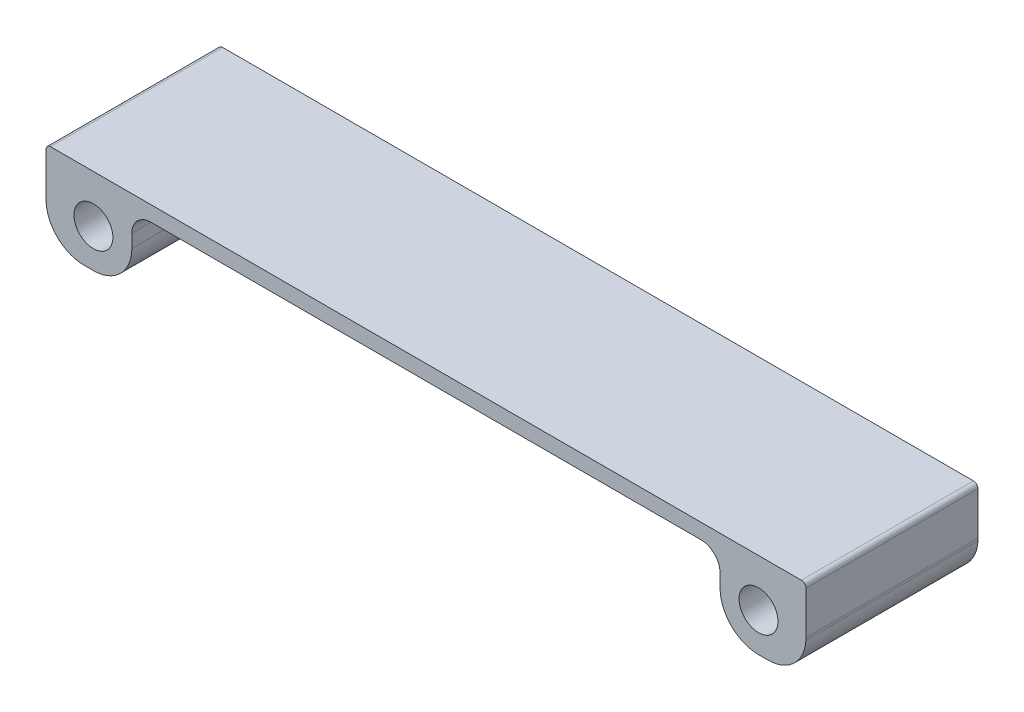
ISO-10303-21;
HEADER;
FILE_DESCRIPTION(('STEP AP214'),'2;1');
FILE_NAME('part.step','',(''),(''),'','','');
FILE_SCHEMA(('AUTOMOTIVE_DESIGN { 1 0 10303 214 1 1 1 1 }'));
ENDSEC;
DATA;
#1=APPLICATION_CONTEXT('core data for automotive mechanical design processes');
#2=APPLICATION_PROTOCOL_DEFINITION('international standard','automotive_design',2000,#1);
#3=PRODUCT_CONTEXT('',#1,'mechanical');
#4=PRODUCT('Part','Part','',(#3));
#5=PRODUCT_RELATED_PRODUCT_CATEGORY('part','',(#4));
#6=PRODUCT_DEFINITION_FORMATION('','',#4);
#7=PRODUCT_DEFINITION_CONTEXT('part definition',#1,'design');
#8=PRODUCT_DEFINITION('design','',#6,#7);
#9=PRODUCT_DEFINITION_SHAPE('','',#8);
#10=(LENGTH_UNIT() NAMED_UNIT(*) SI_UNIT(.MILLI.,.METRE.));
#11=(NAMED_UNIT(*) PLANE_ANGLE_UNIT() SI_UNIT($,.RADIAN.));
#12=(NAMED_UNIT(*) SI_UNIT($,.STERADIAN.) SOLID_ANGLE_UNIT());
#13=UNCERTAINTY_MEASURE_WITH_UNIT(LENGTH_MEASURE(1.E-05),#10,'distance_accuracy_value','');
#14=(GEOMETRIC_REPRESENTATION_CONTEXT(3) GLOBAL_UNCERTAINTY_ASSIGNED_CONTEXT((#13)) GLOBAL_UNIT_ASSIGNED_CONTEXT((#10,
#11,#12)) REPRESENTATION_CONTEXT('',''));
#15=CARTESIAN_POINT('',(0.,0.,0.));
#16=DIRECTION('',(0.,0.,1.));
#17=DIRECTION('',(1.,0.,0.));
#18=AXIS2_PLACEMENT_3D('',#15,#16,#17);
#19=CARTESIAN_POINT('',(111.1504,-6.4262,28.7528));
#20=DIRECTION('',(0.,1.,0.));
#21=DIRECTION('',(0.,0.,1.));
#22=AXIS2_PLACEMENT_3D('',#19,#20,#21);
#23=PLANE('',#22);
#24=DIRECTION('',(0.,0.,-1.));
#25=VECTOR('',#24,1.);
#26=CARTESIAN_POINT('',(112.723355371268,-6.42619999999999,28.7528));
#27=LINE('',#26,#25);
#28=CARTESIAN_POINT('',(112.723355371268,-6.4262,28.7528));
#29=VERTEX_POINT('',#28);
#30=CARTESIAN_POINT('',(112.723355371268,-6.4262,0.));
#31=VERTEX_POINT('',#30);
#32=EDGE_CURVE('E225',#29,#31,#27,.T.);
#33=ORIENTED_EDGE('',*,*,#32,.F.);
#34=DIRECTION('',(1.,0.,0.));
#35=VECTOR('',#34,1.);
#36=CARTESIAN_POINT('',(111.1504,-6.4262,28.7528));
#37=LINE('',#36,#35);
#38=CARTESIAN_POINT('',(111.1504,-6.4262,28.7528));
#39=VERTEX_POINT('',#38);
#40=EDGE_CURVE('E246',#39,#29,#37,.T.);
#41=ORIENTED_EDGE('',*,*,#40,.F.);
#42=DIRECTION('',(0.,0.,-1.));
#43=VECTOR('',#42,1.);
#44=CARTESIAN_POINT('',(111.1504,-6.42619999999999,28.7528));
#45=LINE('',#44,#43);
#46=CARTESIAN_POINT('',(111.1504,-6.4262,0.));
#47=VERTEX_POINT('',#46);
#48=EDGE_CURVE('E222',#47,#39,#45,.F.);
#49=ORIENTED_EDGE('',*,*,#48,.F.);
#50=DIRECTION('',(1.,0.,0.));
#51=VECTOR('',#50,1.);
#52=CARTESIAN_POINT('',(111.1504,-6.4262,0.));
#53=LINE('',#52,#51);
#54=EDGE_CURVE('E248',#31,#47,#53,.F.);
#55=ORIENTED_EDGE('',*,*,#54,.F.);
#56=EDGE_LOOP('',(#33,#41,#49,#55));
#57=FACE_BOUND('',#56,.T.);
#58=ADVANCED_FACE('F19',(#57),#23,.F.);
#59=CARTESIAN_POINT('',(0.,-6.4262,28.7528));
#60=DIRECTION('',(0.,1.,0.));
#61=DIRECTION('',(0.,0.,1.));
#62=AXIS2_PLACEMENT_3D('',#59,#60,#61);
#63=PLANE('',#62);
#64=DIRECTION('',(0.,0.,-1.));
#65=VECTOR('',#64,1.);
#66=CARTESIAN_POINT('',(-1.57295537126772,-6.4262,28.7528));
#67=LINE('',#66,#65);
#68=CARTESIAN_POINT('',(-1.57295537126772,-6.4262,0.));
#69=VERTEX_POINT('',#68);
#70=CARTESIAN_POINT('',(-1.57295537126772,-6.4262,28.7528));
#71=VERTEX_POINT('',#70);
#72=EDGE_CURVE('E155',#69,#71,#67,.F.);
#73=ORIENTED_EDGE('',*,*,#72,.F.);
#74=DIRECTION('',(1.,0.,0.));
#75=VECTOR('',#74,1.);
#76=CARTESIAN_POINT('',(0.,-6.4262,0.));
#77=LINE('',#76,#75);
#78=CARTESIAN_POINT('',(0.,-6.4262,0.));
#79=VERTEX_POINT('',#78);
#80=EDGE_CURVE('E161',#79,#69,#77,.F.);
#81=ORIENTED_EDGE('',*,*,#80,.F.);
#82=DIRECTION('',(0.,0.,-1.));
#83=VECTOR('',#82,1.);
#84=CARTESIAN_POINT('',(0.,-6.4262,28.7528));
#85=LINE('',#84,#83);
#86=CARTESIAN_POINT('',(0.,-6.4262,28.7528));
#87=VERTEX_POINT('',#86);
#88=EDGE_CURVE('E156',#87,#79,#85,.T.);
#89=ORIENTED_EDGE('',*,*,#88,.F.);
#90=DIRECTION('',(1.,0.,0.));
#91=VECTOR('',#90,1.);
#92=CARTESIAN_POINT('',(0.,-6.4262,28.7528));
#93=LINE('',#92,#91);
#94=EDGE_CURVE('E147',#71,#87,#93,.T.);
#95=ORIENTED_EDGE('',*,*,#94,.F.);
#96=EDGE_LOOP('',(#73,#81,#89,#95));
#97=FACE_BOUND('',#96,.T.);
#98=ADVANCED_FACE('F260',(#97),#63,.F.);
#99=CARTESIAN_POINT('',(0.,0.,28.7528));
#100=DIRECTION('',(0.,0.,-1.));
#101=DIRECTION('',(-1.,0.,0.));
#102=AXIS2_PLACEMENT_3D('',#99,#100,#101);
#103=CYLINDRICAL_SURFACE('',#102,7.92479999999999);
#104=CARTESIAN_POINT('',(0.,0.,28.7528));
#105=DIRECTION('',(0.,0.,-1.));
#106=DIRECTION('',(-1.,0.,0.));
#107=AXIS2_PLACEMENT_3D('',#104,#105,#106);
#108=CIRCLE('',#107,7.92479999999999);
#109=CARTESIAN_POINT('',(-7.91551735218598,-0.38345806451614,28.7528));
#110=VERTEX_POINT('',#109);
#111=CARTESIAN_POINT('',(-7.9248,0.,28.7528));
#112=VERTEX_POINT('',#111);
#113=EDGE_CURVE('E146',#110,#112,#108,.T.);
#114=ORIENTED_EDGE('',*,*,#113,.T.);
#115=DIRECTION('',(0.,0.,1.));
#116=VECTOR('',#115,1.);
#117=CARTESIAN_POINT('',(-7.9248,0.,28.7528));
#118=LINE('',#117,#116);
#119=CARTESIAN_POINT('',(-7.9248,0.,0.));
#120=VERTEX_POINT('',#119);
#121=EDGE_CURVE('E144',#112,#120,#118,.F.);
#122=ORIENTED_EDGE('',*,*,#121,.T.);
#123=CARTESIAN_POINT('',(0.,0.,0.));
#124=DIRECTION('',(0.,0.,-1.));
#125=DIRECTION('',(-1.,0.,0.));
#126=AXIS2_PLACEMENT_3D('',#123,#124,#125);
#127=CIRCLE('',#126,7.92479999999999);
#128=CARTESIAN_POINT('',(-7.91551735218598,-0.38345806451614,0.));
#129=VERTEX_POINT('',#128);
#130=EDGE_CURVE('E22',#120,#129,#127,.F.);
#131=ORIENTED_EDGE('',*,*,#130,.T.);
#132=DIRECTION('',(0.,0.,-1.));
#133=VECTOR('',#132,1.);
#134=CARTESIAN_POINT('',(-7.91551735218598,-0.383458064516141,28.7528));
#135=LINE('',#134,#133);
#136=EDGE_CURVE('E141',#110,#129,#135,.T.);
#137=ORIENTED_EDGE('',*,*,#136,.F.);
#138=EDGE_LOOP('',(#114,#122,#131,#137));
#139=FACE_BOUND('',#138,.T.);
#140=ADVANCED_FACE('F140',(#139),#103,.T.);
#141=CARTESIAN_POINT('',(111.1504,0.,28.7528));
#142=DIRECTION('',(0.,0.,-1.));
#143=DIRECTION('',(-1.,0.,0.));
#144=AXIS2_PLACEMENT_3D('',#141,#142,#143);
#145=CYLINDRICAL_SURFACE('',#144,7.9248);
#146=CARTESIAN_POINT('',(111.1504,0.,0.));
#147=DIRECTION('',(0.,0.,-1.));
#148=DIRECTION('',(-1.,0.,0.));
#149=AXIS2_PLACEMENT_3D('',#146,#147,#148);
#150=CIRCLE('',#149,7.9248);
#151=CARTESIAN_POINT('',(119.065917352186,-0.383458064516131,0.));
#152=VERTEX_POINT('',#151);
#153=CARTESIAN_POINT('',(119.0752,0.,0.));
#154=VERTEX_POINT('',#153);
#155=EDGE_CURVE('E560',#152,#154,#150,.F.);
#156=ORIENTED_EDGE('',*,*,#155,.T.);
#157=DIRECTION('',(0.,0.,1.));
#158=VECTOR('',#157,1.);
#159=CARTESIAN_POINT('',(119.0752,0.,28.7528));
#160=LINE('',#159,#158);
#161=CARTESIAN_POINT('',(119.0752,0.,28.7528));
#162=VERTEX_POINT('',#161);
#163=EDGE_CURVE('E313',#154,#162,#160,.T.);
#164=ORIENTED_EDGE('',*,*,#163,.T.);
#165=CARTESIAN_POINT('',(111.1504,0.,28.7528));
#166=DIRECTION('',(0.,0.,-1.));
#167=DIRECTION('',(-1.,0.,0.));
#168=AXIS2_PLACEMENT_3D('',#165,#166,#167);
#169=CIRCLE('',#168,7.9248);
#170=CARTESIAN_POINT('',(119.065917352186,-0.383458064516131,28.7528));
#171=VERTEX_POINT('',#170);
#172=EDGE_CURVE('E559',#162,#171,#169,.T.);
#173=ORIENTED_EDGE('',*,*,#172,.T.);
#174=DIRECTION('',(0.,0.,-1.));
#175=VECTOR('',#174,1.);
#176=CARTESIAN_POINT('',(119.065917352186,-0.38345806451613,28.7528));
#177=LINE('',#176,#175);
#178=EDGE_CURVE('E229',#152,#171,#177,.F.);
#179=ORIENTED_EDGE('',*,*,#178,.F.);
#180=EDGE_LOOP('',(#156,#164,#173,#179));
#181=FACE_BOUND('',#180,.T.);
#182=ADVANCED_FACE('F508',(#181),#145,.T.);
#183=CARTESIAN_POINT('',(112.723355371268,-0.0762000000000002,28.7528));
#184=DIRECTION('',(0.,0.,-1.));
#185=DIRECTION('',(-1.,0.,0.));
#186=AXIS2_PLACEMENT_3D('',#183,#184,#185);
#187=CYLINDRICAL_SURFACE('',#186,6.34999999999999);
#188=CARTESIAN_POINT('',(112.723355371268,-0.0762000000000002,28.7528));
#189=DIRECTION('',(0.,0.,-1.));
#190=DIRECTION('',(-1.,0.,0.));
#191=AXIS2_PLACEMENT_3D('',#188,#189,#190);
#192=CIRCLE('',#191,6.34999999999999);
#193=EDGE_CURVE('E185',#171,#29,#192,.T.);
#194=ORIENTED_EDGE('',*,*,#193,.T.);
#195=ORIENTED_EDGE('',*,*,#32,.T.);
#196=CARTESIAN_POINT('',(112.723355371268,-0.0762000000000002,0.));
#197=DIRECTION('',(0.,0.,-1.));
#198=DIRECTION('',(-1.,0.,0.));
#199=AXIS2_PLACEMENT_3D('',#196,#197,#198);
#200=CIRCLE('',#199,6.34999999999999);
#201=EDGE_CURVE('E325',#152,#31,#200,.T.);
#202=ORIENTED_EDGE('',*,*,#201,.F.);
#203=ORIENTED_EDGE('',*,*,#178,.T.);
#204=EDGE_LOOP('',(#194,#195,#202,#203));
#205=FACE_BOUND('',#204,.T.);
#206=ADVANCED_FACE('F500',(#205),#187,.T.);
#207=CARTESIAN_POINT('',(111.1504,0.,28.7528));
#208=DIRECTION('',(0.,0.,-1.));
#209=DIRECTION('',(-1.,0.,0.));
#210=AXIS2_PLACEMENT_3D('',#207,#208,#209);
#211=CYLINDRICAL_SURFACE('',#210,6.42619999999999);
#212=CARTESIAN_POINT('',(111.1504,0.,28.7528));
#213=DIRECTION('',(0.,0.,-1.));
#214=DIRECTION('',(-1.,0.,0.));
#215=AXIS2_PLACEMENT_3D('',#212,#213,#214);
#216=CIRCLE('',#215,6.42619999999999);
#217=CARTESIAN_POINT('',(104.7242,0.,28.7528));
#218=VERTEX_POINT('',#217);
#219=EDGE_CURVE('E201',#39,#218,#216,.T.);
#220=ORIENTED_EDGE('',*,*,#219,.T.);
#221=DIRECTION('',(0.,0.,1.));
#222=VECTOR('',#221,1.);
#223=CARTESIAN_POINT('',(104.7242,0.,28.7528));
#224=LINE('',#223,#222);
#225=CARTESIAN_POINT('',(104.7242,0.,0.));
#226=VERTEX_POINT('',#225);
#227=EDGE_CURVE('E219',#218,#226,#224,.F.);
#228=ORIENTED_EDGE('',*,*,#227,.T.);
#229=CARTESIAN_POINT('',(111.1504,0.,0.));
#230=DIRECTION('',(0.,0.,-1.));
#231=DIRECTION('',(-1.,0.,0.));
#232=AXIS2_PLACEMENT_3D('',#229,#230,#231);
#233=CIRCLE('',#232,6.42619999999999);
#234=EDGE_CURVE('E296',#47,#226,#233,.T.);
#235=ORIENTED_EDGE('',*,*,#234,.F.);
#236=ORIENTED_EDGE('',*,*,#48,.T.);
#237=EDGE_LOOP('',(#220,#228,#235,#236));
#238=FACE_BOUND('',#237,.T.);
#239=ADVANCED_FACE('F338',(#238),#211,.T.);
#240=CARTESIAN_POINT('',(104.7242,0.,28.7528));
#241=DIRECTION('',(1.,0.,0.));
#242=DIRECTION('',(0.,1.,0.));
#243=AXIS2_PLACEMENT_3D('',#240,#241,#242);
#244=PLANE('',#243);
#245=ORIENTED_EDGE('',*,*,#227,.F.);
#246=DIRECTION('',(0.,1.,0.));
#247=VECTOR('',#246,1.);
#248=CARTESIAN_POINT('',(104.7242,-5.6642,28.7528));
#249=LINE('',#248,#247);
#250=CARTESIAN_POINT('',(104.7242,2.2098,28.7528));
#251=VERTEX_POINT('',#250);
#252=EDGE_CURVE('E200',#218,#251,#249,.T.);
#253=ORIENTED_EDGE('',*,*,#252,.T.);
#254=DIRECTION('',(0.,0.,-1.));
#255=VECTOR('',#254,1.);
#256=CARTESIAN_POINT('',(104.7242,2.2098,28.7528));
#257=LINE('',#256,#255);
#258=CARTESIAN_POINT('',(104.7242,2.2098,0.));
#259=VERTEX_POINT('',#258);
#260=EDGE_CURVE('E213',#251,#259,#257,.T.);
#261=ORIENTED_EDGE('',*,*,#260,.T.);
#262=DIRECTION('',(0.,1.,0.));
#263=VECTOR('',#262,1.);
#264=CARTESIAN_POINT('',(104.7242,-5.6642,0.));
#265=LINE('',#264,#263);
#266=EDGE_CURVE('E292',#226,#259,#265,.T.);
#267=ORIENTED_EDGE('',*,*,#266,.F.);
#268=EDGE_LOOP('',(#245,#253,#261,#267));
#269=FACE_BOUND('',#268,.T.);
#270=ADVANCED_FACE('F342',(#269),#244,.F.);
#271=CARTESIAN_POINT('',(101.5492,2.2098,28.7528));
#272=DIRECTION('',(0.,0.,-1.));
#273=DIRECTION('',(-1.,0.,0.));
#274=AXIS2_PLACEMENT_3D('',#271,#272,#273);
#275=CYLINDRICAL_SURFACE('',#274,3.17500000000001);
#276=ORIENTED_EDGE('',*,*,#260,.F.);
#277=CARTESIAN_POINT('',(101.5492,2.2098,28.7528));
#278=DIRECTION('',(0.,0.,-1.));
#279=DIRECTION('',(-1.,0.,0.));
#280=AXIS2_PLACEMENT_3D('',#277,#278,#279);
#281=CIRCLE('',#280,3.17500000000001);
#282=CARTESIAN_POINT('',(101.5492,5.3848,28.7528));
#283=VERTEX_POINT('',#282);
#284=EDGE_CURVE('E197',#251,#283,#281,.F.);
#285=ORIENTED_EDGE('',*,*,#284,.T.);
#286=DIRECTION('',(0.,0.,1.));
#287=VECTOR('',#286,1.);
#288=CARTESIAN_POINT('',(101.5492,5.3848,28.7528));
#289=LINE('',#288,#287);
#290=CARTESIAN_POINT('',(101.5492,5.3848,0.));
#291=VERTEX_POINT('',#290);
#292=EDGE_CURVE('E218',#283,#291,#289,.F.);
#293=ORIENTED_EDGE('',*,*,#292,.T.);
#294=CARTESIAN_POINT('',(101.5492,2.2098,0.));
#295=DIRECTION('',(0.,0.,-1.));
#296=DIRECTION('',(-1.,0.,0.));
#297=AXIS2_PLACEMENT_3D('',#294,#295,#296);
#298=CIRCLE('',#297,3.17500000000001);
#299=EDGE_CURVE('E285',#259,#291,#298,.F.);
#300=ORIENTED_EDGE('',*,*,#299,.F.);
#301=EDGE_LOOP('',(#276,#285,#293,#300));
#302=FACE_BOUND('',#301,.T.);
#303=ADVANCED_FACE('F284',(#302),#275,.F.);
#304=CARTESIAN_POINT('',(101.5492,5.3848,28.7528));
#305=DIRECTION('',(0.,1.,0.));
#306=DIRECTION('',(-1.,0.,0.));
#307=AXIS2_PLACEMENT_3D('',#304,#305,#306);
#308=PLANE('',#307);
#309=ORIENTED_EDGE('',*,*,#292,.F.);
#310=DIRECTION('',(-1.,0.,0.));
#311=VECTOR('',#310,1.);
#312=CARTESIAN_POINT('',(-7.1628,5.3848,28.7528));
#313=LINE('',#312,#311);
#314=CARTESIAN_POINT('',(9.6012,5.38479999999999,28.7528));
#315=VERTEX_POINT('',#314);
#316=EDGE_CURVE('E196',#283,#315,#313,.T.);
#317=ORIENTED_EDGE('',*,*,#316,.T.);
#318=DIRECTION('',(0.,0.,-1.));
#319=VECTOR('',#318,1.);
#320=CARTESIAN_POINT('',(9.6012,5.38479999999999,28.7528));
#321=LINE('',#320,#319);
#322=CARTESIAN_POINT('',(9.6012,5.38479999999999,0.));
#323=VERTEX_POINT('',#322);
#324=EDGE_CURVE('E272',#315,#323,#321,.T.);
#325=ORIENTED_EDGE('',*,*,#324,.T.);
#326=DIRECTION('',(-1.,0.,0.));
#327=VECTOR('',#326,1.);
#328=CARTESIAN_POINT('',(-7.1628,5.3848,0.));
#329=LINE('',#328,#327);
#330=EDGE_CURVE('E288',#291,#323,#329,.T.);
#331=ORIENTED_EDGE('',*,*,#330,.F.);
#332=EDGE_LOOP('',(#309,#317,#325,#331));
#333=FACE_BOUND('',#332,.T.);
#334=ADVANCED_FACE('F289',(#333),#308,.F.);
#335=CARTESIAN_POINT('',(9.6012,2.20979999999999,28.7528));
#336=DIRECTION('',(0.,0.,-1.));
#337=DIRECTION('',(-1.,0.,0.));
#338=AXIS2_PLACEMENT_3D('',#335,#336,#337);
#339=CYLINDRICAL_SURFACE('',#338,3.175);
#340=ORIENTED_EDGE('',*,*,#324,.F.);
#341=CARTESIAN_POINT('',(9.6012,2.20979999999999,28.7528));
#342=DIRECTION('',(0.,0.,-1.));
#343=DIRECTION('',(-1.,0.,0.));
#344=AXIS2_PLACEMENT_3D('',#341,#342,#343);
#345=CIRCLE('',#344,3.175);
#346=CARTESIAN_POINT('',(6.4262,2.20979999999999,28.7528));
#347=VERTEX_POINT('',#346);
#348=EDGE_CURVE('E193',#315,#347,#345,.F.);
#349=ORIENTED_EDGE('',*,*,#348,.T.);
#350=DIRECTION('',(0.,0.,1.));
#351=VECTOR('',#350,1.);
#352=CARTESIAN_POINT('',(6.4262,2.20979999999999,28.7528));
#353=LINE('',#352,#351);
#354=CARTESIAN_POINT('',(6.4262,2.20979999999999,0.));
#355=VERTEX_POINT('',#354);
#356=EDGE_CURVE('E269',#347,#355,#353,.F.);
#357=ORIENTED_EDGE('',*,*,#356,.T.);
#358=CARTESIAN_POINT('',(9.6012,2.20979999999999,0.));
#359=DIRECTION('',(0.,0.,-1.));
#360=DIRECTION('',(-1.,0.,0.));
#361=AXIS2_PLACEMENT_3D('',#358,#359,#360);
#362=CIRCLE('',#361,3.175);
#363=EDGE_CURVE('E290',#323,#355,#362,.F.);
#364=ORIENTED_EDGE('',*,*,#363,.F.);
#365=EDGE_LOOP('',(#340,#349,#357,#364));
#366=FACE_BOUND('',#365,.T.);
#367=ADVANCED_FACE('F345',(#366),#339,.F.);
#368=CARTESIAN_POINT('',(6.4262,0.,28.7528));
#369=DIRECTION('',(-1.,0.,0.));
#370=DIRECTION('',(0.,0.,1.));
#371=AXIS2_PLACEMENT_3D('',#368,#369,#370);
#372=PLANE('',#371);
#373=ORIENTED_EDGE('',*,*,#356,.F.);
#374=DIRECTION('',(0.,1.,0.));
#375=VECTOR('',#374,1.);
#376=CARTESIAN_POINT('',(6.4262,-5.6642,28.7528));
#377=LINE('',#376,#375);
#378=CARTESIAN_POINT('',(6.4262,0.,28.7528));
#379=VERTEX_POINT('',#378);
#380=EDGE_CURVE('E192',#347,#379,#377,.F.);
#381=ORIENTED_EDGE('',*,*,#380,.T.);
#382=DIRECTION('',(0.,0.,-1.));
#383=VECTOR('',#382,1.);
#384=CARTESIAN_POINT('',(6.4262,0.,28.7528));
#385=LINE('',#384,#383);
#386=CARTESIAN_POINT('',(6.4262,0.,0.));
#387=VERTEX_POINT('',#386);
#388=EDGE_CURVE('E263',#387,#379,#385,.F.);
#389=ORIENTED_EDGE('',*,*,#388,.F.);
#390=DIRECTION('',(0.,1.,0.));
#391=VECTOR('',#390,1.);
#392=CARTESIAN_POINT('',(6.4262,-5.6642,0.));
#393=LINE('',#392,#391);
#394=EDGE_CURVE('E167',#355,#387,#393,.F.);
#395=ORIENTED_EDGE('',*,*,#394,.F.);
#396=EDGE_LOOP('',(#373,#381,#389,#395));
#397=FACE_BOUND('',#396,.T.);
#398=ADVANCED_FACE('F346',(#397),#372,.F.);
#399=CARTESIAN_POINT('',(0.,0.,28.7528));
#400=DIRECTION('',(0.,0.,-1.));
#401=DIRECTION('',(-1.,0.,0.));
#402=AXIS2_PLACEMENT_3D('',#399,#400,#401);
#403=CYLINDRICAL_SURFACE('',#402,6.4262);
#404=CARTESIAN_POINT('',(0.,0.,28.7528));
#405=DIRECTION('',(0.,0.,-1.));
#406=DIRECTION('',(-1.,0.,0.));
#407=AXIS2_PLACEMENT_3D('',#404,#405,#406);
#408=CIRCLE('',#407,6.4262);
#409=EDGE_CURVE('E188',#379,#87,#408,.T.);
#410=ORIENTED_EDGE('',*,*,#409,.T.);
#411=ORIENTED_EDGE('',*,*,#88,.T.);
#412=CARTESIAN_POINT('',(0.,0.,0.));
#413=DIRECTION('',(0.,0.,-1.));
#414=DIRECTION('',(-1.,0.,0.));
#415=AXIS2_PLACEMENT_3D('',#412,#413,#414);
#416=CIRCLE('',#415,6.4262);
#417=EDGE_CURVE('E164',#387,#79,#416,.T.);
#418=ORIENTED_EDGE('',*,*,#417,.F.);
#419=ORIENTED_EDGE('',*,*,#388,.T.);
#420=EDGE_LOOP('',(#410,#411,#418,#419));
#421=FACE_BOUND('',#420,.T.);
#422=ADVANCED_FACE('F265',(#421),#403,.T.);
#423=CARTESIAN_POINT('',(-1.57295537126772,-0.0762000000000002,28.7528));
#424=DIRECTION('',(0.,0.,-1.));
#425=DIRECTION('',(-1.,0.,0.));
#426=AXIS2_PLACEMENT_3D('',#423,#424,#425);
#427=CYLINDRICAL_SURFACE('',#426,6.35);
#428=CARTESIAN_POINT('',(-1.57295537126772,-0.0762000000000002,0.));
#429=DIRECTION('',(0.,0.,-1.));
#430=DIRECTION('',(-1.,0.,0.));
#431=AXIS2_PLACEMENT_3D('',#428,#429,#430);
#432=CIRCLE('',#431,6.35);
#433=EDGE_CURVE('E152',#69,#129,#432,.T.);
#434=ORIENTED_EDGE('',*,*,#433,.F.);
#435=ORIENTED_EDGE('',*,*,#72,.T.);
#436=CARTESIAN_POINT('',(-1.57295537126772,-0.0762000000000002,28.7528));
#437=DIRECTION('',(0.,0.,-1.));
#438=DIRECTION('',(-1.,0.,0.));
#439=AXIS2_PLACEMENT_3D('',#436,#437,#438);
#440=CIRCLE('',#439,6.35);
#441=EDGE_CURVE('E154',#71,#110,#440,.T.);
#442=ORIENTED_EDGE('',*,*,#441,.T.);
#443=ORIENTED_EDGE('',*,*,#136,.T.);
#444=EDGE_LOOP('',(#434,#435,#442,#443));
#445=FACE_BOUND('',#444,.T.);
#446=ADVANCED_FACE('F150',(#445),#427,.T.);
#447=CARTESIAN_POINT('',(-7.9248,7.16279999999999,28.7528));
#448=DIRECTION('',(1.,0.,0.));
#449=DIRECTION('',(0.,1.,0.));
#450=AXIS2_PLACEMENT_3D('',#447,#448,#449);
#451=PLANE('',#450);
#452=ORIENTED_EDGE('',*,*,#121,.F.);
#453=DIRECTION('',(0.,1.,0.));
#454=VECTOR('',#453,1.);
#455=CARTESIAN_POINT('',(-7.9248,-5.6642,28.7528));
#456=LINE('',#455,#454);
#457=CARTESIAN_POINT('',(-7.9248,7.1628,28.7528));
#458=VERTEX_POINT('',#457);
#459=EDGE_CURVE('E184',#112,#458,#456,.T.);
#460=ORIENTED_EDGE('',*,*,#459,.T.);
#461=DIRECTION('',(0.,0.,-1.));
#462=VECTOR('',#461,1.);
#463=CARTESIAN_POINT('',(-7.9248,7.1628,28.7528));
#464=LINE('',#463,#462);
#465=CARTESIAN_POINT('',(-7.9248,7.1628,0.));
#466=VERTEX_POINT('',#465);
#467=EDGE_CURVE('E319',#466,#458,#464,.F.);
#468=ORIENTED_EDGE('',*,*,#467,.F.);
#469=DIRECTION('',(0.,1.,0.));
#470=VECTOR('',#469,1.);
#471=CARTESIAN_POINT('',(-7.9248,-5.6642,0.));
#472=LINE('',#471,#470);
#473=EDGE_CURVE('E163',#120,#466,#472,.T.);
#474=ORIENTED_EDGE('',*,*,#473,.F.);
#475=EDGE_LOOP('',(#452,#460,#468,#474));
#476=FACE_BOUND('',#475,.T.);
#477=ADVANCED_FACE('F387',(#476),#451,.F.);
#478=CARTESIAN_POINT('',(119.0752,7.16279999999999,28.7528));
#479=DIRECTION('',(-1.,0.,0.));
#480=DIRECTION('',(0.,0.,1.));
#481=AXIS2_PLACEMENT_3D('',#478,#479,#480);
#482=PLANE('',#481);
#483=DIRECTION('',(0.,1.,0.));
#484=VECTOR('',#483,1.);
#485=CARTESIAN_POINT('',(119.0752,-5.6642,0.));
#486=LINE('',#485,#484);
#487=CARTESIAN_POINT('',(119.0752,7.1628,0.));
#488=VERTEX_POINT('',#487);
#489=EDGE_CURVE('E238',#488,#154,#486,.F.);
#490=ORIENTED_EDGE('',*,*,#489,.F.);
#491=DIRECTION('',(0.,0.,-1.));
#492=VECTOR('',#491,1.);
#493=CARTESIAN_POINT('',(119.0752,7.16279999999999,28.7528));
#494=LINE('',#493,#492);
#495=CARTESIAN_POINT('',(119.0752,7.1628,28.7528));
#496=VERTEX_POINT('',#495);
#497=EDGE_CURVE('E316',#496,#488,#494,.T.);
#498=ORIENTED_EDGE('',*,*,#497,.F.);
#499=DIRECTION('',(0.,1.,0.));
#500=VECTOR('',#499,1.);
#501=CARTESIAN_POINT('',(119.0752,-5.6642,28.7528));
#502=LINE('',#501,#500);
#503=EDGE_CURVE('E183',#496,#162,#502,.F.);
#504=ORIENTED_EDGE('',*,*,#503,.T.);
#505=ORIENTED_EDGE('',*,*,#163,.F.);
#506=EDGE_LOOP('',(#490,#498,#504,#505));
#507=FACE_BOUND('',#506,.T.);
#508=ADVANCED_FACE('F383',(#507),#482,.F.);
#509=CARTESIAN_POINT('',(0.,0.,28.7528));
#510=DIRECTION('',(0.,0.,-1.));
#511=DIRECTION('',(-1.,0.,0.));
#512=AXIS2_PLACEMENT_3D('',#509,#510,#511);
#513=CYLINDRICAL_SURFACE('',#512,3.2512);
#514=CARTESIAN_POINT('',(0.,0.,28.7528));
#515=DIRECTION('',(0.,0.,-1.));
#516=DIRECTION('',(-1.,0.,0.));
#517=AXIS2_PLACEMENT_3D('',#514,#515,#516);
#518=CIRCLE('',#517,3.2512);
#519=CARTESIAN_POINT('',(-3.2512,0.,28.7528));
#520=VERTEX_POINT('',#519);
#521=EDGE_CURVE('E205',#520,#520,#518,.F.);
#522=ORIENTED_EDGE('',*,*,#521,.T.);
#523=EDGE_LOOP('',(#522));
#524=FACE_BOUND('',#523,.T.);
#525=CARTESIAN_POINT('',(0.,0.,0.));
#526=DIRECTION('',(0.,0.,-1.));
#527=DIRECTION('',(-1.,0.,0.));
#528=AXIS2_PLACEMENT_3D('',#525,#526,#527);
#529=CIRCLE('',#528,3.2512);
#530=CARTESIAN_POINT('',(-3.2512,0.,0.));
#531=VERTEX_POINT('',#530);
#532=EDGE_CURVE('E239',#531,#531,#529,.F.);
#533=ORIENTED_EDGE('',*,*,#532,.F.);
#534=EDGE_LOOP('',(#533));
#535=FACE_BOUND('',#534,.T.);
#536=ADVANCED_FACE('F380',(#524,#535),#513,.F.);
#537=CARTESIAN_POINT('',(111.1504,0.,28.7528));
#538=DIRECTION('',(0.,0.,-1.));
#539=DIRECTION('',(-1.,0.,0.));
#540=AXIS2_PLACEMENT_3D('',#537,#538,#539);
#541=CYLINDRICAL_SURFACE('',#540,3.2512);
#542=CARTESIAN_POINT('',(111.1504,0.,28.7528));
#543=DIRECTION('',(0.,0.,-1.));
#544=DIRECTION('',(-1.,0.,0.));
#545=AXIS2_PLACEMENT_3D('',#542,#543,#544);
#546=CIRCLE('',#545,3.2512);
#547=CARTESIAN_POINT('',(107.8992,0.,28.7528));
#548=VERTEX_POINT('',#547);
#549=EDGE_CURVE('E322',#548,#548,#546,.F.);
#550=ORIENTED_EDGE('',*,*,#549,.T.);
#551=EDGE_LOOP('',(#550));
#552=FACE_BOUND('',#551,.T.);
#553=CARTESIAN_POINT('',(111.1504,0.,0.));
#554=DIRECTION('',(0.,0.,-1.));
#555=DIRECTION('',(-1.,0.,0.));
#556=AXIS2_PLACEMENT_3D('',#553,#554,#555);
#557=CIRCLE('',#556,3.2512);
#558=CARTESIAN_POINT('',(107.8992,0.,0.));
#559=VERTEX_POINT('',#558);
#560=EDGE_CURVE('E242',#559,#559,#557,.F.);
#561=ORIENTED_EDGE('',*,*,#560,.F.);
#562=EDGE_LOOP('',(#561));
#563=FACE_BOUND('',#562,.T.);
#564=ADVANCED_FACE('F376',(#552,#563),#541,.F.);
#565=CARTESIAN_POINT('',(118.3132,7.1628,28.7528));
#566=DIRECTION('',(0.,0.,-1.));
#567=DIRECTION('',(-1.,0.,0.));
#568=AXIS2_PLACEMENT_3D('',#565,#566,#567);
#569=CYLINDRICAL_SURFACE('',#568,0.761999999999999);
#570=CARTESIAN_POINT('',(118.3132,7.1628,28.7528));
#571=DIRECTION('',(0.,0.,-1.));
#572=DIRECTION('',(-1.,0.,0.));
#573=AXIS2_PLACEMENT_3D('',#570,#571,#572);
#574=CIRCLE('',#573,0.761999999999999);
#575=CARTESIAN_POINT('',(118.3132,7.9248,28.7528));
#576=VERTEX_POINT('',#575);
#577=EDGE_CURVE('E178',#576,#496,#574,.T.);
#578=ORIENTED_EDGE('',*,*,#577,.T.);
#579=ORIENTED_EDGE('',*,*,#497,.T.);
#580=CARTESIAN_POINT('',(118.3132,7.1628,0.));
#581=DIRECTION('',(0.,0.,-1.));
#582=DIRECTION('',(-1.,0.,0.));
#583=AXIS2_PLACEMENT_3D('',#580,#581,#582);
#584=CIRCLE('',#583,0.761999999999999);
#585=CARTESIAN_POINT('',(118.3132,7.9248,0.));
#586=VERTEX_POINT('',#585);
#587=EDGE_CURVE('E235',#586,#488,#584,.T.);
#588=ORIENTED_EDGE('',*,*,#587,.F.);
#589=DIRECTION('',(0.,0.,-1.));
#590=VECTOR('',#589,1.);
#591=CARTESIAN_POINT('',(118.3132,7.9248,28.7528));
#592=LINE('',#591,#590);
#593=EDGE_CURVE('E245',#586,#576,#592,.F.);
#594=ORIENTED_EDGE('',*,*,#593,.T.);
#595=EDGE_LOOP('',(#578,#579,#588,#594));
#596=FACE_BOUND('',#595,.T.);
#597=ADVANCED_FACE('F372',(#596),#569,.T.);
#598=CARTESIAN_POINT('',(-7.1628,-5.6642,28.7528));
#599=DIRECTION('',(0.,0.,-1.));
#600=DIRECTION('',(-1.,0.,0.));
#601=AXIS2_PLACEMENT_3D('',#598,#599,#600);
#602=PLANE('',#601);
#603=ORIENTED_EDGE('',*,*,#549,.F.);
#604=EDGE_LOOP('',(#603));
#605=FACE_BOUND('',#604,.T.);
#606=ORIENTED_EDGE('',*,*,#193,.F.);
#607=ORIENTED_EDGE('',*,*,#172,.F.);
#608=ORIENTED_EDGE('',*,*,#503,.F.);
#609=ORIENTED_EDGE('',*,*,#577,.F.);
#610=DIRECTION('',(1.,0.,0.));
#611=VECTOR('',#610,1.);
#612=CARTESIAN_POINT('',(-7.16279999999999,7.9248,28.7528));
#613=LINE('',#612,#611);
#614=CARTESIAN_POINT('',(-7.1628,7.9248,28.7528));
#615=VERTEX_POINT('',#614);
#616=EDGE_CURVE('E299',#576,#615,#613,.F.);
#617=ORIENTED_EDGE('',*,*,#616,.T.);
#618=CARTESIAN_POINT('',(-7.1628,7.1628,28.7528));
#619=DIRECTION('',(0.,0.,-1.));
#620=DIRECTION('',(-1.,0.,0.));
#621=AXIS2_PLACEMENT_3D('',#618,#619,#620);
#622=CIRCLE('',#621,0.762000000000001);
#623=EDGE_CURVE('E321',#458,#615,#622,.T.);
#624=ORIENTED_EDGE('',*,*,#623,.F.);
#625=ORIENTED_EDGE('',*,*,#459,.F.);
#626=ORIENTED_EDGE('',*,*,#113,.F.);
#627=ORIENTED_EDGE('',*,*,#441,.F.);
#628=ORIENTED_EDGE('',*,*,#94,.T.);
#629=ORIENTED_EDGE('',*,*,#409,.F.);
#630=ORIENTED_EDGE('',*,*,#380,.F.);
#631=ORIENTED_EDGE('',*,*,#348,.F.);
#632=ORIENTED_EDGE('',*,*,#316,.F.);
#633=ORIENTED_EDGE('',*,*,#284,.F.);
#634=ORIENTED_EDGE('',*,*,#252,.F.);
#635=ORIENTED_EDGE('',*,*,#219,.F.);
#636=ORIENTED_EDGE('',*,*,#40,.T.);
#637=EDGE_LOOP('',(#606,#607,#608,#609,#617,#624,#625,#626,#627,#628,#629,#630,#631,#632,#633,
#634,#635,#636));
#638=FACE_BOUND('',#637,.T.);
#639=ORIENTED_EDGE('',*,*,#521,.F.);
#640=EDGE_LOOP('',(#639));
#641=FACE_BOUND('',#640,.T.);
#642=ADVANCED_FACE('F254',(#605,#638,#641),#602,.F.);
#643=CARTESIAN_POINT('',(-7.1628,7.1628,28.7528));
#644=DIRECTION('',(0.,0.,-1.));
#645=DIRECTION('',(-1.,0.,0.));
#646=AXIS2_PLACEMENT_3D('',#643,#644,#645);
#647=CYLINDRICAL_SURFACE('',#646,0.762000000000001);
#648=ORIENTED_EDGE('',*,*,#623,.T.);
#649=DIRECTION('',(0.,0.,-1.));
#650=VECTOR('',#649,1.);
#651=CARTESIAN_POINT('',(-7.16279999999999,7.9248,28.7528));
#652=LINE('',#651,#650);
#653=CARTESIAN_POINT('',(-7.1628,7.9248,0.));
#654=VERTEX_POINT('',#653);
#655=EDGE_CURVE('E28',#615,#654,#652,.T.);
#656=ORIENTED_EDGE('',*,*,#655,.T.);
#657=CARTESIAN_POINT('',(-7.1628,7.1628,0.));
#658=DIRECTION('',(0.,0.,-1.));
#659=DIRECTION('',(-1.,0.,0.));
#660=AXIS2_PLACEMENT_3D('',#657,#658,#659);
#661=CIRCLE('',#660,0.762000000000001);
#662=EDGE_CURVE('E36',#466,#654,#661,.T.);
#663=ORIENTED_EDGE('',*,*,#662,.F.);
#664=ORIENTED_EDGE('',*,*,#467,.T.);
#665=EDGE_LOOP('',(#648,#656,#663,#664));
#666=FACE_BOUND('',#665,.T.);
#667=ADVANCED_FACE('F363',(#666),#647,.T.);
#668=CARTESIAN_POINT('',(-7.1628,-5.6642,0.));
#669=DIRECTION('',(0.,0.,-1.));
#670=DIRECTION('',(-1.,0.,0.));
#671=AXIS2_PLACEMENT_3D('',#668,#669,#670);
#672=PLANE('',#671);
#673=ORIENTED_EDGE('',*,*,#560,.T.);
#674=EDGE_LOOP('',(#673));
#675=FACE_BOUND('',#674,.T.);
#676=ORIENTED_EDGE('',*,*,#532,.T.);
#677=EDGE_LOOP('',(#676));
#678=FACE_BOUND('',#677,.T.);
#679=ORIENTED_EDGE('',*,*,#587,.T.);
#680=ORIENTED_EDGE('',*,*,#489,.T.);
#681=ORIENTED_EDGE('',*,*,#155,.F.);
#682=ORIENTED_EDGE('',*,*,#201,.T.);
#683=ORIENTED_EDGE('',*,*,#54,.T.);
#684=ORIENTED_EDGE('',*,*,#234,.T.);
#685=ORIENTED_EDGE('',*,*,#266,.T.);
#686=ORIENTED_EDGE('',*,*,#299,.T.);
#687=ORIENTED_EDGE('',*,*,#330,.T.);
#688=ORIENTED_EDGE('',*,*,#363,.T.);
#689=ORIENTED_EDGE('',*,*,#394,.T.);
#690=ORIENTED_EDGE('',*,*,#417,.T.);
#691=ORIENTED_EDGE('',*,*,#80,.T.);
#692=ORIENTED_EDGE('',*,*,#433,.T.);
#693=ORIENTED_EDGE('',*,*,#130,.F.);
#694=ORIENTED_EDGE('',*,*,#473,.T.);
#695=ORIENTED_EDGE('',*,*,#662,.T.);
#696=DIRECTION('',(1.,0.,0.));
#697=VECTOR('',#696,1.);
#698=CARTESIAN_POINT('',(-7.16279999999999,7.9248,0.));
#699=LINE('',#698,#697);
#700=EDGE_CURVE('E12',#654,#586,#699,.T.);
#701=ORIENTED_EDGE('',*,*,#700,.T.);
#702=EDGE_LOOP('',(#679,#680,#681,#682,#683,#684,#685,#686,#687,#688,#689,#690,#691,#692,#693,
#694,#695,#701));
#703=FACE_BOUND('',#702,.T.);
#704=ADVANCED_FACE('F159',(#675,#678,#703),#672,.T.);
#705=CARTESIAN_POINT('',(-7.16279999999999,7.9248,28.7528));
#706=DIRECTION('',(0.,-1.,0.));
#707=DIRECTION('',(0.,0.,-1.));
#708=AXIS2_PLACEMENT_3D('',#705,#706,#707);
#709=PLANE('',#708);
#710=ORIENTED_EDGE('',*,*,#655,.F.);
#711=ORIENTED_EDGE('',*,*,#616,.F.);
#712=ORIENTED_EDGE('',*,*,#593,.F.);
#713=ORIENTED_EDGE('',*,*,#700,.F.);
#714=EDGE_LOOP('',(#710,#711,#712,#713));
#715=FACE_BOUND('',#714,.T.);
#716=ADVANCED_FACE('F356',(#715),#709,.F.);
#717=CLOSED_SHELL('',(#58,#98,#140,#182,#206,#239,#270,#303,#334,#367,#398,#422,#446,#477,#508,
#536,#564,#597,#642,#667,#704,#716));
#718=MANIFOLD_SOLID_BREP('B1',#717);
#719=ADVANCED_BREP_SHAPE_REPRESENTATION('',(#18,#718),#14);
#720=SHAPE_DEFINITION_REPRESENTATION(#9,#719);
ENDSEC;
END-ISO-10303-21;
